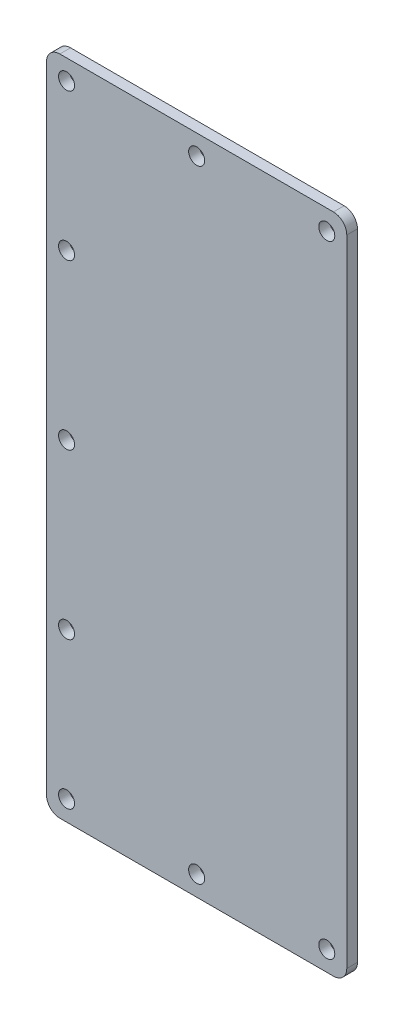
ISO-10303-21;
HEADER;
FILE_DESCRIPTION(('STEP AP214'),'2;1');
FILE_NAME('part.step','',(''),(''),'','','');
FILE_SCHEMA(('AUTOMOTIVE_DESIGN { 1 0 10303 214 1 1 1 1 }'));
ENDSEC;
DATA;
#1=APPLICATION_CONTEXT('core data for automotive mechanical design processes');
#2=APPLICATION_PROTOCOL_DEFINITION('international standard','automotive_design',2000,#1);
#3=PRODUCT_CONTEXT('',#1,'mechanical');
#4=PRODUCT('Part','Part','',(#3));
#5=PRODUCT_RELATED_PRODUCT_CATEGORY('part','',(#4));
#6=PRODUCT_DEFINITION_FORMATION('','',#4);
#7=PRODUCT_DEFINITION_CONTEXT('part definition',#1,'design');
#8=PRODUCT_DEFINITION('design','',#6,#7);
#9=PRODUCT_DEFINITION_SHAPE('','',#8);
#10=(LENGTH_UNIT() NAMED_UNIT(*) SI_UNIT(.MILLI.,.METRE.));
#11=(NAMED_UNIT(*) PLANE_ANGLE_UNIT() SI_UNIT($,.RADIAN.));
#12=(NAMED_UNIT(*) SI_UNIT($,.STERADIAN.) SOLID_ANGLE_UNIT());
#13=UNCERTAINTY_MEASURE_WITH_UNIT(LENGTH_MEASURE(1.E-05),#10,'distance_accuracy_value','');
#14=(GEOMETRIC_REPRESENTATION_CONTEXT(3) GLOBAL_UNCERTAINTY_ASSIGNED_CONTEXT((#13)) GLOBAL_UNIT_ASSIGNED_CONTEXT((#10,
#11,#12)) REPRESENTATION_CONTEXT('',''));
#15=CARTESIAN_POINT('',(0.,0.,0.));
#16=DIRECTION('',(0.,0.,1.));
#17=DIRECTION('',(1.,0.,0.));
#18=AXIS2_PLACEMENT_3D('',#15,#16,#17);
#19=CARTESIAN_POINT('',(215.,10.,8.));
#20=DIRECTION('',(0.,0.,-1.));
#21=DIRECTION('',(-1.,0.,0.));
#22=AXIS2_PLACEMENT_3D('',#19,#20,#21);
#23=CYLINDRICAL_SURFACE('',#22,10.);
#24=CARTESIAN_POINT('',(215.,10.,0.));
#25=DIRECTION('',(0.,0.,1.));
#26=DIRECTION('',(1.,0.,0.));
#27=AXIS2_PLACEMENT_3D('',#24,#25,#26);
#28=CIRCLE('',#27,10.);
#29=CARTESIAN_POINT('',(215.,0.,0.));
#30=VERTEX_POINT('',#29);
#31=CARTESIAN_POINT('',(225.,10.0000000000001,0.));
#32=VERTEX_POINT('',#31);
#33=EDGE_CURVE('E132',#30,#32,#28,.T.);
#34=ORIENTED_EDGE('',*,*,#33,.T.);
#35=DIRECTION('',(0.,0.,-1.));
#36=VECTOR('',#35,1.);
#37=CARTESIAN_POINT('',(225.,10.0000000000001,8.));
#38=LINE('',#37,#36);
#39=CARTESIAN_POINT('',(225.,10.0000000000001,8.));
#40=VERTEX_POINT('',#39);
#41=EDGE_CURVE('E11',#40,#32,#38,.T.);
#42=ORIENTED_EDGE('',*,*,#41,.F.);
#43=CARTESIAN_POINT('',(215.,10.,8.));
#44=DIRECTION('',(0.,0.,1.));
#45=DIRECTION('',(1.,0.,0.));
#46=AXIS2_PLACEMENT_3D('',#43,#44,#45);
#47=CIRCLE('',#46,10.);
#48=CARTESIAN_POINT('',(215.,0.,8.));
#49=VERTEX_POINT('',#48);
#50=EDGE_CURVE('E146',#49,#40,#47,.T.);
#51=ORIENTED_EDGE('',*,*,#50,.F.);
#52=DIRECTION('',(0.,0.,-1.));
#53=VECTOR('',#52,1.);
#54=CARTESIAN_POINT('',(215.,0.,8.));
#55=LINE('',#54,#53);
#56=EDGE_CURVE('E128',#49,#30,#55,.T.);
#57=ORIENTED_EDGE('',*,*,#56,.T.);
#58=EDGE_LOOP('',(#34,#42,#51,#57));
#59=FACE_BOUND('',#58,.T.);
#60=ADVANCED_FACE('F34',(#59),#23,.T.);
#61=CARTESIAN_POINT('',(225.,10.0000000000001,8.));
#62=DIRECTION('',(-1.,0.,0.));
#63=DIRECTION('',(0.,0.,1.));
#64=AXIS2_PLACEMENT_3D('',#61,#62,#63);
#65=PLANE('',#64);
#66=DIRECTION('',(0.,1.,0.));
#67=VECTOR('',#66,1.);
#68=CARTESIAN_POINT('',(225.,10.0000000000001,0.));
#69=LINE('',#68,#67);
#70=CARTESIAN_POINT('',(225.,486.,0.));
#71=VERTEX_POINT('',#70);
#72=EDGE_CURVE('E135',#32,#71,#69,.T.);
#73=ORIENTED_EDGE('',*,*,#72,.T.);
#74=DIRECTION('',(0.,0.,-1.));
#75=VECTOR('',#74,1.);
#76=CARTESIAN_POINT('',(225.,486.,8.));
#77=LINE('',#76,#75);
#78=CARTESIAN_POINT('',(225.,486.,8.));
#79=VERTEX_POINT('',#78);
#80=EDGE_CURVE('E43',#79,#71,#77,.T.);
#81=ORIENTED_EDGE('',*,*,#80,.F.);
#82=DIRECTION('',(0.,1.,0.));
#83=VECTOR('',#82,1.);
#84=CARTESIAN_POINT('',(225.,10.0000000000001,8.));
#85=LINE('',#84,#83);
#86=EDGE_CURVE('E95',#40,#79,#85,.T.);
#87=ORIENTED_EDGE('',*,*,#86,.F.);
#88=ORIENTED_EDGE('',*,*,#41,.T.);
#89=EDGE_LOOP('',(#73,#81,#87,#88));
#90=FACE_BOUND('',#89,.T.);
#91=ADVANCED_FACE('F202',(#90),#65,.F.);
#92=CARTESIAN_POINT('',(215.,486.,8.));
#93=DIRECTION('',(0.,0.,-1.));
#94=DIRECTION('',(-1.,0.,0.));
#95=AXIS2_PLACEMENT_3D('',#92,#93,#94);
#96=CYLINDRICAL_SURFACE('',#95,10.);
#97=CARTESIAN_POINT('',(215.,486.,0.));
#98=DIRECTION('',(0.,0.,1.));
#99=DIRECTION('',(-1.,0.,0.));
#100=AXIS2_PLACEMENT_3D('',#97,#98,#99);
#101=CIRCLE('',#100,10.);
#102=CARTESIAN_POINT('',(215.,496.,0.));
#103=VERTEX_POINT('',#102);
#104=EDGE_CURVE('E137',#71,#103,#101,.T.);
#105=ORIENTED_EDGE('',*,*,#104,.T.);
#106=DIRECTION('',(0.,0.,-1.));
#107=VECTOR('',#106,1.);
#108=CARTESIAN_POINT('',(215.,496.,8.));
#109=LINE('',#108,#107);
#110=CARTESIAN_POINT('',(215.,496.,8.));
#111=VERTEX_POINT('',#110);
#112=EDGE_CURVE('E153',#111,#103,#109,.T.);
#113=ORIENTED_EDGE('',*,*,#112,.F.);
#114=CARTESIAN_POINT('',(215.,486.,8.));
#115=DIRECTION('',(0.,0.,1.));
#116=DIRECTION('',(-1.,0.,0.));
#117=AXIS2_PLACEMENT_3D('',#114,#115,#116);
#118=CIRCLE('',#117,10.);
#119=EDGE_CURVE('E217',#79,#111,#118,.T.);
#120=ORIENTED_EDGE('',*,*,#119,.F.);
#121=ORIENTED_EDGE('',*,*,#80,.T.);
#122=EDGE_LOOP('',(#105,#113,#120,#121));
#123=FACE_BOUND('',#122,.T.);
#124=ADVANCED_FACE('F207',(#123),#96,.T.);
#125=CARTESIAN_POINT('',(10.0000000000001,496.,8.));
#126=DIRECTION('',(0.,-1.,0.));
#127=DIRECTION('',(0.,0.,-1.));
#128=AXIS2_PLACEMENT_3D('',#125,#126,#127);
#129=PLANE('',#128);
#130=DIRECTION('',(-1.,0.,0.));
#131=VECTOR('',#130,1.);
#132=CARTESIAN_POINT('',(10.0000000000001,496.,0.));
#133=LINE('',#132,#131);
#134=CARTESIAN_POINT('',(10.0000000000001,496.,0.));
#135=VERTEX_POINT('',#134);
#136=EDGE_CURVE('E139',#103,#135,#133,.T.);
#137=ORIENTED_EDGE('',*,*,#136,.T.);
#138=DIRECTION('',(0.,0.,-1.));
#139=VECTOR('',#138,1.);
#140=CARTESIAN_POINT('',(10.0000000000001,496.,8.));
#141=LINE('',#140,#139);
#142=CARTESIAN_POINT('',(10.0000000000001,496.,8.));
#143=VERTEX_POINT('',#142);
#144=EDGE_CURVE('E150',#143,#135,#141,.T.);
#145=ORIENTED_EDGE('',*,*,#144,.F.);
#146=DIRECTION('',(-1.,0.,0.));
#147=VECTOR('',#146,1.);
#148=CARTESIAN_POINT('',(10.0000000000001,496.,8.));
#149=LINE('',#148,#147);
#150=EDGE_CURVE('E219',#111,#143,#149,.T.);
#151=ORIENTED_EDGE('',*,*,#150,.F.);
#152=ORIENTED_EDGE('',*,*,#112,.T.);
#153=EDGE_LOOP('',(#137,#145,#151,#152));
#154=FACE_BOUND('',#153,.T.);
#155=ADVANCED_FACE('F286',(#154),#129,.F.);
#156=CARTESIAN_POINT('',(10.,486.,8.));
#157=DIRECTION('',(0.,0.,-1.));
#158=DIRECTION('',(-1.,0.,0.));
#159=AXIS2_PLACEMENT_3D('',#156,#157,#158);
#160=CYLINDRICAL_SURFACE('',#159,10.);
#161=CARTESIAN_POINT('',(10.,486.,0.));
#162=DIRECTION('',(0.,0.,1.));
#163=DIRECTION('',(-1.,0.,0.));
#164=AXIS2_PLACEMENT_3D('',#161,#162,#163);
#165=CIRCLE('',#164,10.);
#166=CARTESIAN_POINT('',(0.,486.,0.));
#167=VERTEX_POINT('',#166);
#168=EDGE_CURVE('E141',#135,#167,#165,.T.);
#169=ORIENTED_EDGE('',*,*,#168,.T.);
#170=DIRECTION('',(0.,0.,-1.));
#171=VECTOR('',#170,1.);
#172=CARTESIAN_POINT('',(0.,486.,8.));
#173=LINE('',#172,#171);
#174=CARTESIAN_POINT('',(0.,486.,8.));
#175=VERTEX_POINT('',#174);
#176=EDGE_CURVE('E123',#175,#167,#173,.T.);
#177=ORIENTED_EDGE('',*,*,#176,.F.);
#178=CARTESIAN_POINT('',(10.,486.,8.));
#179=DIRECTION('',(0.,0.,1.));
#180=DIRECTION('',(-1.,0.,0.));
#181=AXIS2_PLACEMENT_3D('',#178,#179,#180);
#182=CIRCLE('',#181,10.);
#183=EDGE_CURVE('E114',#143,#175,#182,.T.);
#184=ORIENTED_EDGE('',*,*,#183,.F.);
#185=ORIENTED_EDGE('',*,*,#144,.T.);
#186=EDGE_LOOP('',(#169,#177,#184,#185));
#187=FACE_BOUND('',#186,.T.);
#188=ADVANCED_FACE('F283',(#187),#160,.T.);
#189=CARTESIAN_POINT('',(0.,10.0000000000001,8.));
#190=DIRECTION('',(1.,0.,0.));
#191=DIRECTION('',(0.,0.,-1.));
#192=AXIS2_PLACEMENT_3D('',#189,#190,#191);
#193=PLANE('',#192);
#194=DIRECTION('',(0.,-1.,0.));
#195=VECTOR('',#194,1.);
#196=CARTESIAN_POINT('',(0.,10.0000000000001,0.));
#197=LINE('',#196,#195);
#198=CARTESIAN_POINT('',(0.,10.,0.));
#199=VERTEX_POINT('',#198);
#200=EDGE_CURVE('E122',#167,#199,#197,.T.);
#201=ORIENTED_EDGE('',*,*,#200,.T.);
#202=DIRECTION('',(0.,0.,-1.));
#203=VECTOR('',#202,1.);
#204=CARTESIAN_POINT('',(0.,10.,8.));
#205=LINE('',#204,#203);
#206=CARTESIAN_POINT('',(0.,10.,8.));
#207=VERTEX_POINT('',#206);
#208=EDGE_CURVE('E119',#207,#199,#205,.T.);
#209=ORIENTED_EDGE('',*,*,#208,.F.);
#210=DIRECTION('',(0.,-1.,0.));
#211=VECTOR('',#210,1.);
#212=CARTESIAN_POINT('',(0.,10.0000000000001,8.));
#213=LINE('',#212,#211);
#214=EDGE_CURVE('E108',#175,#207,#213,.T.);
#215=ORIENTED_EDGE('',*,*,#214,.F.);
#216=ORIENTED_EDGE('',*,*,#176,.T.);
#217=EDGE_LOOP('',(#201,#209,#215,#216));
#218=FACE_BOUND('',#217,.T.);
#219=ADVANCED_FACE('F120',(#218),#193,.F.);
#220=CARTESIAN_POINT('',(10.,10.,8.));
#221=DIRECTION('',(0.,0.,-1.));
#222=DIRECTION('',(-1.,0.,0.));
#223=AXIS2_PLACEMENT_3D('',#220,#221,#222);
#224=CYLINDRICAL_SURFACE('',#223,10.);
#225=CARTESIAN_POINT('',(10.,10.,0.));
#226=DIRECTION('',(0.,0.,1.));
#227=DIRECTION('',(-1.,0.,0.));
#228=AXIS2_PLACEMENT_3D('',#225,#226,#227);
#229=CIRCLE('',#228,10.);
#230=CARTESIAN_POINT('',(10.0000000000001,0.,0.));
#231=VERTEX_POINT('',#230);
#232=EDGE_CURVE('E81',#199,#231,#229,.T.);
#233=ORIENTED_EDGE('',*,*,#232,.T.);
#234=DIRECTION('',(0.,0.,-1.));
#235=VECTOR('',#234,1.);
#236=CARTESIAN_POINT('',(10.0000000000001,0.,8.));
#237=LINE('',#236,#235);
#238=CARTESIAN_POINT('',(10.0000000000001,0.,8.));
#239=VERTEX_POINT('',#238);
#240=EDGE_CURVE('E124',#239,#231,#237,.T.);
#241=ORIENTED_EDGE('',*,*,#240,.F.);
#242=CARTESIAN_POINT('',(10.,10.,8.));
#243=DIRECTION('',(0.,0.,1.));
#244=DIRECTION('',(-1.,0.,0.));
#245=AXIS2_PLACEMENT_3D('',#242,#243,#244);
#246=CIRCLE('',#245,10.);
#247=EDGE_CURVE('E112',#207,#239,#246,.T.);
#248=ORIENTED_EDGE('',*,*,#247,.F.);
#249=ORIENTED_EDGE('',*,*,#208,.T.);
#250=EDGE_LOOP('',(#233,#241,#248,#249));
#251=FACE_BOUND('',#250,.T.);
#252=ADVANCED_FACE('F126',(#251),#224,.T.);
#253=CARTESIAN_POINT('',(10.0000000000001,0.,8.));
#254=DIRECTION('',(0.,1.,0.));
#255=DIRECTION('',(0.,0.,1.));
#256=AXIS2_PLACEMENT_3D('',#253,#254,#255);
#257=PLANE('',#256);
#258=DIRECTION('',(1.,0.,0.));
#259=VECTOR('',#258,1.);
#260=CARTESIAN_POINT('',(10.0000000000001,0.,0.));
#261=LINE('',#260,#259);
#262=EDGE_CURVE('E87',#231,#30,#261,.T.);
#263=ORIENTED_EDGE('',*,*,#262,.T.);
#264=ORIENTED_EDGE('',*,*,#56,.F.);
#265=DIRECTION('',(1.,0.,0.));
#266=VECTOR('',#265,1.);
#267=CARTESIAN_POINT('',(10.0000000000001,0.,8.));
#268=LINE('',#267,#266);
#269=EDGE_CURVE('E52',#239,#49,#268,.T.);
#270=ORIENTED_EDGE('',*,*,#269,.F.);
#271=ORIENTED_EDGE('',*,*,#240,.T.);
#272=EDGE_LOOP('',(#263,#264,#270,#271));
#273=FACE_BOUND('',#272,.T.);
#274=ADVANCED_FACE('F256',(#273),#257,.F.);
#275=CARTESIAN_POINT('',(215.,10.,8.));
#276=DIRECTION('',(0.,0.,1.));
#277=DIRECTION('',(1.,0.,0.));
#278=AXIS2_PLACEMENT_3D('',#275,#276,#277);
#279=PLANE('',#278);
#280=CARTESIAN_POINT('',(210.,481.,8.));
#281=DIRECTION('',(0.,0.,1.));
#282=DIRECTION('',(1.,0.,0.));
#283=AXIS2_PLACEMENT_3D('',#280,#281,#282);
#284=CIRCLE('',#283,6.00000000000002);
#285=CARTESIAN_POINT('',(216.,481.,8.));
#286=VERTEX_POINT('',#285);
#287=EDGE_CURVE('E227',#286,#286,#284,.T.);
#288=ORIENTED_EDGE('',*,*,#287,.F.);
#289=EDGE_LOOP('',(#288));
#290=FACE_BOUND('',#289,.T.);
#291=CARTESIAN_POINT('',(15.,481.,8.));
#292=DIRECTION('',(0.,0.,1.));
#293=DIRECTION('',(1.,0.,0.));
#294=AXIS2_PLACEMENT_3D('',#291,#292,#293);
#295=CIRCLE('',#294,6.);
#296=CARTESIAN_POINT('',(21.,481.,8.));
#297=VERTEX_POINT('',#296);
#298=EDGE_CURVE('E235',#297,#297,#295,.T.);
#299=ORIENTED_EDGE('',*,*,#298,.F.);
#300=EDGE_LOOP('',(#299));
#301=FACE_BOUND('',#300,.T.);
#302=CARTESIAN_POINT('',(15.,15.,8.));
#303=DIRECTION('',(0.,0.,1.));
#304=DIRECTION('',(1.,0.,0.));
#305=AXIS2_PLACEMENT_3D('',#302,#303,#304);
#306=CIRCLE('',#305,6.);
#307=CARTESIAN_POINT('',(21.,15.,8.));
#308=VERTEX_POINT('',#307);
#309=EDGE_CURVE('E231',#308,#308,#306,.T.);
#310=ORIENTED_EDGE('',*,*,#309,.F.);
#311=EDGE_LOOP('',(#310));
#312=FACE_BOUND('',#311,.T.);
#313=CARTESIAN_POINT('',(210.,15.,8.));
#314=DIRECTION('',(0.,0.,1.));
#315=DIRECTION('',(1.,0.,0.));
#316=AXIS2_PLACEMENT_3D('',#313,#314,#315);
#317=CIRCLE('',#316,6.00000000000002);
#318=CARTESIAN_POINT('',(216.,15.,8.));
#319=VERTEX_POINT('',#318);
#320=EDGE_CURVE('E228',#319,#319,#317,.T.);
#321=ORIENTED_EDGE('',*,*,#320,.F.);
#322=EDGE_LOOP('',(#321));
#323=FACE_BOUND('',#322,.T.);
#324=CARTESIAN_POINT('',(15.,125.,8.));
#325=DIRECTION('',(0.,0.,1.));
#326=DIRECTION('',(1.,0.,0.));
#327=AXIS2_PLACEMENT_3D('',#324,#325,#326);
#328=CIRCLE('',#327,6.);
#329=CARTESIAN_POINT('',(21.,125.,8.));
#330=VERTEX_POINT('',#329);
#331=EDGE_CURVE('E245',#330,#330,#328,.T.);
#332=ORIENTED_EDGE('',*,*,#331,.F.);
#333=EDGE_LOOP('',(#332));
#334=FACE_BOUND('',#333,.T.);
#335=CARTESIAN_POINT('',(15.,371.,8.));
#336=DIRECTION('',(0.,0.,1.));
#337=DIRECTION('',(1.,0.,0.));
#338=AXIS2_PLACEMENT_3D('',#335,#336,#337);
#339=CIRCLE('',#338,6.);
#340=CARTESIAN_POINT('',(21.,371.,8.));
#341=VERTEX_POINT('',#340);
#342=EDGE_CURVE('E242',#341,#341,#339,.T.);
#343=ORIENTED_EDGE('',*,*,#342,.F.);
#344=EDGE_LOOP('',(#343));
#345=FACE_BOUND('',#344,.T.);
#346=CARTESIAN_POINT('',(15.,248.,8.));
#347=DIRECTION('',(0.,0.,1.));
#348=DIRECTION('',(1.,0.,0.));
#349=AXIS2_PLACEMENT_3D('',#346,#347,#348);
#350=CIRCLE('',#349,6.);
#351=CARTESIAN_POINT('',(21.,248.,8.));
#352=VERTEX_POINT('',#351);
#353=EDGE_CURVE('E239',#352,#352,#350,.T.);
#354=ORIENTED_EDGE('',*,*,#353,.F.);
#355=EDGE_LOOP('',(#354));
#356=FACE_BOUND('',#355,.T.);
#357=CARTESIAN_POINT('',(112.5,15.,8.));
#358=DIRECTION('',(0.,0.,1.));
#359=DIRECTION('',(1.,0.,0.));
#360=AXIS2_PLACEMENT_3D('',#357,#358,#359);
#361=CIRCLE('',#360,6.);
#362=CARTESIAN_POINT('',(118.5,15.,8.));
#363=VERTEX_POINT('',#362);
#364=EDGE_CURVE('E232',#363,#363,#361,.T.);
#365=ORIENTED_EDGE('',*,*,#364,.F.);
#366=EDGE_LOOP('',(#365));
#367=FACE_BOUND('',#366,.T.);
#368=CARTESIAN_POINT('',(112.5,481.,8.));
#369=DIRECTION('',(0.,0.,1.));
#370=DIRECTION('',(1.,0.,0.));
#371=AXIS2_PLACEMENT_3D('',#368,#369,#370);
#372=CIRCLE('',#371,6.);
#373=CARTESIAN_POINT('',(118.5,481.,8.));
#374=VERTEX_POINT('',#373);
#375=EDGE_CURVE('E162',#374,#374,#372,.T.);
#376=ORIENTED_EDGE('',*,*,#375,.F.);
#377=EDGE_LOOP('',(#376));
#378=FACE_BOUND('',#377,.T.);
#379=ORIENTED_EDGE('',*,*,#50,.T.);
#380=ORIENTED_EDGE('',*,*,#86,.T.);
#381=ORIENTED_EDGE('',*,*,#119,.T.);
#382=ORIENTED_EDGE('',*,*,#150,.T.);
#383=ORIENTED_EDGE('',*,*,#183,.T.);
#384=ORIENTED_EDGE('',*,*,#214,.T.);
#385=ORIENTED_EDGE('',*,*,#247,.T.);
#386=ORIENTED_EDGE('',*,*,#269,.T.);
#387=EDGE_LOOP('',(#379,#380,#381,#382,#383,#384,#385,#386));
#388=FACE_BOUND('',#387,.T.);
#389=ADVANCED_FACE('F110',(#290,#301,#312,#323,#334,#345,#356,#367,#378,#388),#279,.T.);
#390=CARTESIAN_POINT('',(215.,10.,0.));
#391=DIRECTION('',(0.,0.,1.));
#392=DIRECTION('',(1.,0.,0.));
#393=AXIS2_PLACEMENT_3D('',#390,#391,#392);
#394=PLANE('',#393);
#395=CARTESIAN_POINT('',(210.,481.,0.));
#396=DIRECTION('',(0.,0.,1.));
#397=DIRECTION('',(1.,0.,0.));
#398=AXIS2_PLACEMENT_3D('',#395,#396,#397);
#399=CIRCLE('',#398,6.00000000000002);
#400=CARTESIAN_POINT('',(216.,481.,0.));
#401=VERTEX_POINT('',#400);
#402=EDGE_CURVE('E37',#401,#401,#399,.T.);
#403=ORIENTED_EDGE('',*,*,#402,.T.);
#404=EDGE_LOOP('',(#403));
#405=FACE_BOUND('',#404,.T.);
#406=CARTESIAN_POINT('',(15.,481.,0.));
#407=DIRECTION('',(0.,0.,1.));
#408=DIRECTION('',(1.,0.,0.));
#409=AXIS2_PLACEMENT_3D('',#406,#407,#408);
#410=CIRCLE('',#409,6.);
#411=CARTESIAN_POINT('',(21.,481.,0.));
#412=VERTEX_POINT('',#411);
#413=EDGE_CURVE('E179',#412,#412,#410,.T.);
#414=ORIENTED_EDGE('',*,*,#413,.T.);
#415=EDGE_LOOP('',(#414));
#416=FACE_BOUND('',#415,.T.);
#417=CARTESIAN_POINT('',(15.,15.,0.));
#418=DIRECTION('',(0.,0.,1.));
#419=DIRECTION('',(1.,0.,0.));
#420=AXIS2_PLACEMENT_3D('',#417,#418,#419);
#421=CIRCLE('',#420,6.);
#422=CARTESIAN_POINT('',(21.,15.,0.));
#423=VERTEX_POINT('',#422);
#424=EDGE_CURVE('E177',#423,#423,#421,.T.);
#425=ORIENTED_EDGE('',*,*,#424,.T.);
#426=EDGE_LOOP('',(#425));
#427=FACE_BOUND('',#426,.T.);
#428=CARTESIAN_POINT('',(210.,15.,0.));
#429=DIRECTION('',(0.,0.,1.));
#430=DIRECTION('',(1.,0.,0.));
#431=AXIS2_PLACEMENT_3D('',#428,#429,#430);
#432=CIRCLE('',#431,6.00000000000002);
#433=CARTESIAN_POINT('',(216.,15.,0.));
#434=VERTEX_POINT('',#433);
#435=EDGE_CURVE('E174',#434,#434,#432,.T.);
#436=ORIENTED_EDGE('',*,*,#435,.T.);
#437=EDGE_LOOP('',(#436));
#438=FACE_BOUND('',#437,.T.);
#439=CARTESIAN_POINT('',(15.,125.,0.));
#440=DIRECTION('',(0.,0.,1.));
#441=DIRECTION('',(1.,0.,0.));
#442=AXIS2_PLACEMENT_3D('',#439,#440,#441);
#443=CIRCLE('',#442,6.);
#444=CARTESIAN_POINT('',(21.,125.,0.));
#445=VERTEX_POINT('',#444);
#446=EDGE_CURVE('E171',#445,#445,#443,.T.);
#447=ORIENTED_EDGE('',*,*,#446,.T.);
#448=EDGE_LOOP('',(#447));
#449=FACE_BOUND('',#448,.T.);
#450=CARTESIAN_POINT('',(15.,371.,0.));
#451=DIRECTION('',(0.,0.,1.));
#452=DIRECTION('',(1.,0.,0.));
#453=AXIS2_PLACEMENT_3D('',#450,#451,#452);
#454=CIRCLE('',#453,6.);
#455=CARTESIAN_POINT('',(21.,371.,0.));
#456=VERTEX_POINT('',#455);
#457=EDGE_CURVE('E168',#456,#456,#454,.T.);
#458=ORIENTED_EDGE('',*,*,#457,.T.);
#459=EDGE_LOOP('',(#458));
#460=FACE_BOUND('',#459,.T.);
#461=CARTESIAN_POINT('',(15.,248.,0.));
#462=DIRECTION('',(0.,0.,1.));
#463=DIRECTION('',(1.,0.,0.));
#464=AXIS2_PLACEMENT_3D('',#461,#462,#463);
#465=CIRCLE('',#464,6.);
#466=CARTESIAN_POINT('',(21.,248.,0.));
#467=VERTEX_POINT('',#466);
#468=EDGE_CURVE('E165',#467,#467,#465,.T.);
#469=ORIENTED_EDGE('',*,*,#468,.T.);
#470=EDGE_LOOP('',(#469));
#471=FACE_BOUND('',#470,.T.);
#472=CARTESIAN_POINT('',(112.5,15.,0.));
#473=DIRECTION('',(0.,0.,1.));
#474=DIRECTION('',(1.,0.,0.));
#475=AXIS2_PLACEMENT_3D('',#472,#473,#474);
#476=CIRCLE('',#475,6.);
#477=CARTESIAN_POINT('',(118.5,15.,0.));
#478=VERTEX_POINT('',#477);
#479=EDGE_CURVE('E161',#478,#478,#476,.T.);
#480=ORIENTED_EDGE('',*,*,#479,.T.);
#481=EDGE_LOOP('',(#480));
#482=FACE_BOUND('',#481,.T.);
#483=CARTESIAN_POINT('',(112.5,481.,0.));
#484=DIRECTION('',(0.,0.,1.));
#485=DIRECTION('',(1.,0.,0.));
#486=AXIS2_PLACEMENT_3D('',#483,#484,#485);
#487=CIRCLE('',#486,6.);
#488=CARTESIAN_POINT('',(118.5,481.,0.));
#489=VERTEX_POINT('',#488);
#490=EDGE_CURVE('E158',#489,#489,#487,.T.);
#491=ORIENTED_EDGE('',*,*,#490,.T.);
#492=EDGE_LOOP('',(#491));
#493=FACE_BOUND('',#492,.T.);
#494=ORIENTED_EDGE('',*,*,#33,.F.);
#495=ORIENTED_EDGE('',*,*,#262,.F.);
#496=ORIENTED_EDGE('',*,*,#232,.F.);
#497=ORIENTED_EDGE('',*,*,#200,.F.);
#498=ORIENTED_EDGE('',*,*,#168,.F.);
#499=ORIENTED_EDGE('',*,*,#136,.F.);
#500=ORIENTED_EDGE('',*,*,#104,.F.);
#501=ORIENTED_EDGE('',*,*,#72,.F.);
#502=EDGE_LOOP('',(#494,#495,#496,#497,#498,#499,#500,#501));
#503=FACE_BOUND('',#502,.T.);
#504=ADVANCED_FACE('F186',(#405,#416,#427,#438,#449,#460,#471,#482,#493,#503),#394,.F.);
#505=CARTESIAN_POINT('',(112.5,481.,-2.));
#506=DIRECTION('',(0.,0.,1.));
#507=DIRECTION('',(1.,0.,0.));
#508=AXIS2_PLACEMENT_3D('',#505,#506,#507);
#509=CYLINDRICAL_SURFACE('',#508,6.);
#510=ORIENTED_EDGE('',*,*,#375,.T.);
#511=EDGE_LOOP('',(#510));
#512=FACE_BOUND('',#511,.T.);
#513=ORIENTED_EDGE('',*,*,#490,.F.);
#514=EDGE_LOOP('',(#513));
#515=FACE_BOUND('',#514,.T.);
#516=ADVANCED_FACE('F265',(#512,#515),#509,.F.);
#517=CARTESIAN_POINT('',(112.5,15.,-2.));
#518=DIRECTION('',(0.,0.,1.));
#519=DIRECTION('',(1.,0.,0.));
#520=AXIS2_PLACEMENT_3D('',#517,#518,#519);
#521=CYLINDRICAL_SURFACE('',#520,6.);
#522=ORIENTED_EDGE('',*,*,#364,.T.);
#523=EDGE_LOOP('',(#522));
#524=FACE_BOUND('',#523,.T.);
#525=ORIENTED_EDGE('',*,*,#479,.F.);
#526=EDGE_LOOP('',(#525));
#527=FACE_BOUND('',#526,.T.);
#528=ADVANCED_FACE('F268',(#524,#527),#521,.F.);
#529=CARTESIAN_POINT('',(15.,248.,-2.));
#530=DIRECTION('',(0.,0.,1.));
#531=DIRECTION('',(1.,0.,0.));
#532=AXIS2_PLACEMENT_3D('',#529,#530,#531);
#533=CYLINDRICAL_SURFACE('',#532,6.);
#534=ORIENTED_EDGE('',*,*,#353,.T.);
#535=EDGE_LOOP('',(#534));
#536=FACE_BOUND('',#535,.T.);
#537=ORIENTED_EDGE('',*,*,#468,.F.);
#538=EDGE_LOOP('',(#537));
#539=FACE_BOUND('',#538,.T.);
#540=ADVANCED_FACE('F339',(#536,#539),#533,.F.);
#541=CARTESIAN_POINT('',(15.,371.,-2.));
#542=DIRECTION('',(0.,0.,1.));
#543=DIRECTION('',(1.,0.,0.));
#544=AXIS2_PLACEMENT_3D('',#541,#542,#543);
#545=CYLINDRICAL_SURFACE('',#544,6.);
#546=ORIENTED_EDGE('',*,*,#342,.T.);
#547=EDGE_LOOP('',(#546));
#548=FACE_BOUND('',#547,.T.);
#549=ORIENTED_EDGE('',*,*,#457,.F.);
#550=EDGE_LOOP('',(#549));
#551=FACE_BOUND('',#550,.T.);
#552=ADVANCED_FACE('F251',(#548,#551),#545,.F.);
#553=CARTESIAN_POINT('',(15.,125.,-2.));
#554=DIRECTION('',(0.,0.,1.));
#555=DIRECTION('',(1.,0.,0.));
#556=AXIS2_PLACEMENT_3D('',#553,#554,#555);
#557=CYLINDRICAL_SURFACE('',#556,6.);
#558=ORIENTED_EDGE('',*,*,#331,.T.);
#559=EDGE_LOOP('',(#558));
#560=FACE_BOUND('',#559,.T.);
#561=ORIENTED_EDGE('',*,*,#446,.F.);
#562=EDGE_LOOP('',(#561));
#563=FACE_BOUND('',#562,.T.);
#564=ADVANCED_FACE('F357',(#560,#563),#557,.F.);
#565=CARTESIAN_POINT('',(210.,15.,-2.));
#566=DIRECTION('',(0.,0.,1.));
#567=DIRECTION('',(1.,0.,0.));
#568=AXIS2_PLACEMENT_3D('',#565,#566,#567);
#569=CYLINDRICAL_SURFACE('',#568,6.00000000000002);
#570=ORIENTED_EDGE('',*,*,#320,.T.);
#571=EDGE_LOOP('',(#570));
#572=FACE_BOUND('',#571,.T.);
#573=ORIENTED_EDGE('',*,*,#435,.F.);
#574=EDGE_LOOP('',(#573));
#575=FACE_BOUND('',#574,.T.);
#576=ADVANCED_FACE('F366',(#572,#575),#569,.F.);
#577=CARTESIAN_POINT('',(15.,15.,-2.));
#578=DIRECTION('',(0.,0.,1.));
#579=DIRECTION('',(1.,0.,0.));
#580=AXIS2_PLACEMENT_3D('',#577,#578,#579);
#581=CYLINDRICAL_SURFACE('',#580,6.);
#582=ORIENTED_EDGE('',*,*,#309,.T.);
#583=EDGE_LOOP('',(#582));
#584=FACE_BOUND('',#583,.T.);
#585=ORIENTED_EDGE('',*,*,#424,.F.);
#586=EDGE_LOOP('',(#585));
#587=FACE_BOUND('',#586,.T.);
#588=ADVANCED_FACE('F196',(#584,#587),#581,.F.);
#589=CARTESIAN_POINT('',(15.,481.,-2.));
#590=DIRECTION('',(0.,0.,1.));
#591=DIRECTION('',(1.,0.,0.));
#592=AXIS2_PLACEMENT_3D('',#589,#590,#591);
#593=CYLINDRICAL_SURFACE('',#592,6.);
#594=ORIENTED_EDGE('',*,*,#298,.T.);
#595=EDGE_LOOP('',(#594));
#596=FACE_BOUND('',#595,.T.);
#597=ORIENTED_EDGE('',*,*,#413,.F.);
#598=EDGE_LOOP('',(#597));
#599=FACE_BOUND('',#598,.T.);
#600=ADVANCED_FACE('F190',(#596,#599),#593,.F.);
#601=CARTESIAN_POINT('',(210.,481.,-2.));
#602=DIRECTION('',(0.,0.,1.));
#603=DIRECTION('',(1.,0.,0.));
#604=AXIS2_PLACEMENT_3D('',#601,#602,#603);
#605=CYLINDRICAL_SURFACE('',#604,6.00000000000002);
#606=ORIENTED_EDGE('',*,*,#287,.T.);
#607=EDGE_LOOP('',(#606));
#608=FACE_BOUND('',#607,.T.);
#609=ORIENTED_EDGE('',*,*,#402,.F.);
#610=EDGE_LOOP('',(#609));
#611=FACE_BOUND('',#610,.T.);
#612=ADVANCED_FACE('F188',(#608,#611),#605,.F.);
#613=CLOSED_SHELL('',(#60,#91,#124,#155,#188,#219,#252,#274,#389,#504,#516,#528,#540,#552,#564,
#576,#588,#600,#612));
#614=MANIFOLD_SOLID_BREP('B2',#613);
#615=ADVANCED_BREP_SHAPE_REPRESENTATION('',(#18,#614),#14);
#616=SHAPE_DEFINITION_REPRESENTATION(#9,#615);
ENDSEC;
END-ISO-10303-21;
